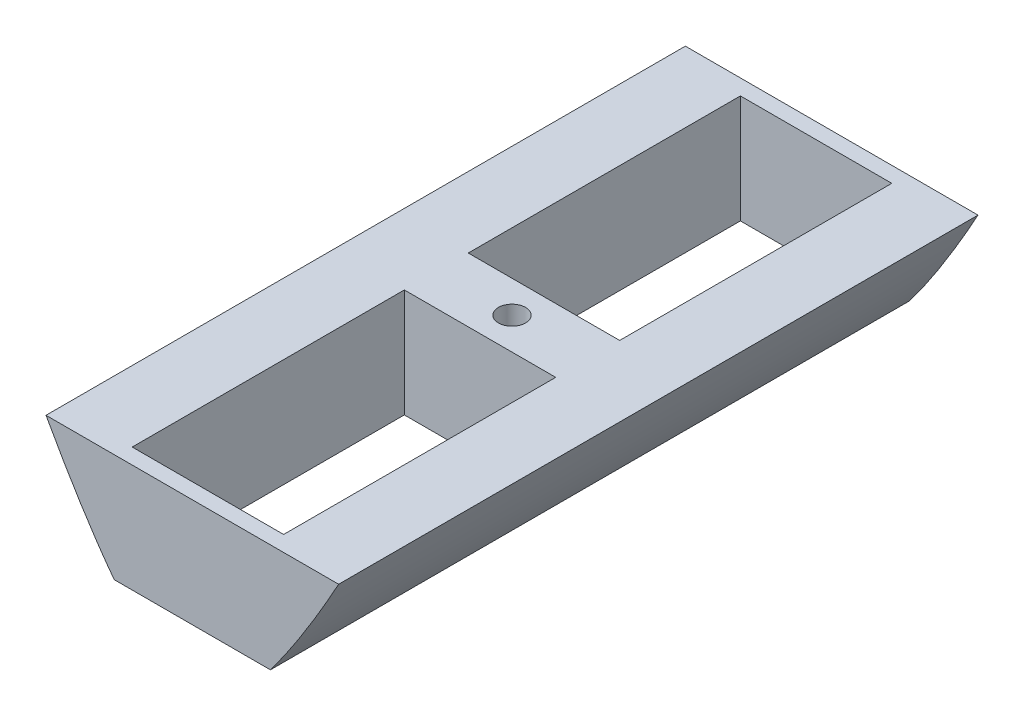
ISO-10303-21;
HEADER;
FILE_DESCRIPTION(('STEP AP214'),'2;1');
FILE_NAME('part.step','',(''),(''),'','','');
FILE_SCHEMA(('AUTOMOTIVE_DESIGN { 1 0 10303 214 1 1 1 1 }'));
ENDSEC;
DATA;
#1=APPLICATION_CONTEXT('core data for automotive mechanical design processes');
#2=APPLICATION_PROTOCOL_DEFINITION('international standard','automotive_design',2000,#1);
#3=PRODUCT_CONTEXT('',#1,'mechanical');
#4=PRODUCT('Part','Part','',(#3));
#5=PRODUCT_RELATED_PRODUCT_CATEGORY('part','',(#4));
#6=PRODUCT_DEFINITION_FORMATION('','',#4);
#7=PRODUCT_DEFINITION_CONTEXT('part definition',#1,'design');
#8=PRODUCT_DEFINITION('design','',#6,#7);
#9=PRODUCT_DEFINITION_SHAPE('','',#8);
#10=(LENGTH_UNIT() NAMED_UNIT(*) SI_UNIT(.MILLI.,.METRE.));
#11=(NAMED_UNIT(*) PLANE_ANGLE_UNIT() SI_UNIT($,.RADIAN.));
#12=(NAMED_UNIT(*) SI_UNIT($,.STERADIAN.) SOLID_ANGLE_UNIT());
#13=UNCERTAINTY_MEASURE_WITH_UNIT(LENGTH_MEASURE(1.E-05),#10,'distance_accuracy_value','');
#14=(GEOMETRIC_REPRESENTATION_CONTEXT(3) GLOBAL_UNCERTAINTY_ASSIGNED_CONTEXT((#13)) GLOBAL_UNIT_ASSIGNED_CONTEXT((#10,
#11,#12)) REPRESENTATION_CONTEXT('',''));
#15=CARTESIAN_POINT('',(0.,0.,0.));
#16=DIRECTION('',(0.,0.,1.));
#17=DIRECTION('',(1.,0.,0.));
#18=AXIS2_PLACEMENT_3D('',#15,#16,#17);
#19=CARTESIAN_POINT('',(0.,-92.52,0.));
#20=DIRECTION('',(0.,1.,0.));
#21=DIRECTION('',(0.,0.,1.));
#22=AXIS2_PLACEMENT_3D('',#19,#20,#21);
#23=PLANE('',#22);
#24=DIRECTION('',(1.,0.,0.));
#25=VECTOR('',#24,1.);
#26=CARTESIAN_POINT('',(-52.7426338619544,-92.52,-150.));
#27=LINE('',#26,#25);
#28=CARTESIAN_POINT('',(-36.6476947811617,-92.5200000005668,-150.));
#29=VERTEX_POINT('',#28);
#30=CARTESIAN_POINT('',(36.6477010865553,-92.5199999999962,-150.));
#31=VERTEX_POINT('',#30);
#32=EDGE_CURVE('E177',#29,#31,#27,.T.);
#33=ORIENTED_EDGE('',*,*,#32,.T.);
#34=DIRECTION('',(0.,0.,1.));
#35=VECTOR('',#34,1.);
#36=CARTESIAN_POINT('',(36.6477010865525,-92.52,-150.));
#37=LINE('',#36,#35);
#38=CARTESIAN_POINT('',(36.6477010865553,-92.5199999999962,150.));
#39=VERTEX_POINT('',#38);
#40=EDGE_CURVE('E133',#31,#39,#37,.T.);
#41=ORIENTED_EDGE('',*,*,#40,.T.);
#42=DIRECTION('',(1.,0.,0.));
#43=VECTOR('',#42,1.);
#44=CARTESIAN_POINT('',(-52.7426338619544,-92.52,150.));
#45=LINE('',#44,#43);
#46=CARTESIAN_POINT('',(-36.6476947811617,-92.5200000005668,150.));
#47=VERTEX_POINT('',#46);
#48=EDGE_CURVE('E137',#47,#39,#45,.T.);
#49=ORIENTED_EDGE('',*,*,#48,.F.);
#50=DIRECTION('',(0.,0.,1.));
#51=VECTOR('',#50,1.);
#52=CARTESIAN_POINT('',(-36.647694781587,-92.5200000000014,-150.));
#53=LINE('',#52,#51);
#54=EDGE_CURVE('E121',#47,#29,#53,.F.);
#55=ORIENTED_EDGE('',*,*,#54,.T.);
#56=EDGE_LOOP('',(#33,#41,#49,#55));
#57=FACE_BOUND('',#56,.T.);
#58=DIRECTION('',(0.,0.,1.));
#59=VECTOR('',#58,1.);
#60=CARTESIAN_POINT('',(-35.5200000000431,-92.5199999999835,-142.682));
#61=LINE('',#60,#59);
#62=CARTESIAN_POINT('',(-35.5200000000431,-92.5199999999835,-142.682));
#63=VERTEX_POINT('',#62);
#64=CARTESIAN_POINT('',(-35.5200000000431,-92.5199999999835,-15.));
#65=VERTEX_POINT('',#64);
#66=EDGE_CURVE('E289',#63,#65,#61,.T.);
#67=ORIENTED_EDGE('',*,*,#66,.T.);
#68=DIRECTION('',(1.,-4.6610767750375E-13,0.));
#69=VECTOR('',#68,1.);
#70=CARTESIAN_POINT('',(35.5199999999569,-92.5200000000166,-15.));
#71=LINE('',#70,#69);
#72=CARTESIAN_POINT('',(35.5199999999569,-92.5200000000166,-15.));
#73=VERTEX_POINT('',#72);
#74=EDGE_CURVE('E293',#65,#73,#71,.T.);
#75=ORIENTED_EDGE('',*,*,#74,.T.);
#76=DIRECTION('',(0.,0.,-1.));
#77=VECTOR('',#76,1.);
#78=CARTESIAN_POINT('',(35.5199999999569,-92.5200000000166,-142.682));
#79=LINE('',#78,#77);
#80=CARTESIAN_POINT('',(35.5199999999569,-92.5200000000166,-142.682));
#81=VERTEX_POINT('',#80);
#82=EDGE_CURVE('E296',#73,#81,#79,.T.);
#83=ORIENTED_EDGE('',*,*,#82,.T.);
#84=DIRECTION('',(-1.,4.6610767750375E-13,0.));
#85=VECTOR('',#84,1.);
#86=CARTESIAN_POINT('',(35.5199999999569,-92.5200000000166,-142.682));
#87=LINE('',#86,#85);
#88=EDGE_CURVE('E174',#81,#63,#87,.T.);
#89=ORIENTED_EDGE('',*,*,#88,.T.);
#90=EDGE_LOOP('',(#67,#75,#83,#89));
#91=FACE_BOUND('',#90,.T.);
#92=DIRECTION('',(0.,0.,-1.));
#93=VECTOR('',#92,1.);
#94=CARTESIAN_POINT('',(35.5199999999569,-92.5200000000166,142.682));
#95=LINE('',#94,#93);
#96=CARTESIAN_POINT('',(35.5199999999569,-92.5200000000166,142.682));
#97=VERTEX_POINT('',#96);
#98=CARTESIAN_POINT('',(35.5199999999569,-92.5200000000166,15.));
#99=VERTEX_POINT('',#98);
#100=EDGE_CURVE('E11',#97,#99,#95,.T.);
#101=ORIENTED_EDGE('',*,*,#100,.T.);
#102=DIRECTION('',(-1.,4.6610767750375E-13,0.));
#103=VECTOR('',#102,1.);
#104=CARTESIAN_POINT('',(35.5199999999569,-92.5200000000166,15.));
#105=LINE('',#104,#103);
#106=CARTESIAN_POINT('',(-35.5200000000431,-92.5199999999835,15.));
#107=VERTEX_POINT('',#106);
#108=EDGE_CURVE('E41',#99,#107,#105,.T.);
#109=ORIENTED_EDGE('',*,*,#108,.T.);
#110=DIRECTION('',(0.,0.,1.));
#111=VECTOR('',#110,1.);
#112=CARTESIAN_POINT('',(-35.5200000000431,-92.5199999999835,142.682));
#113=LINE('',#112,#111);
#114=CARTESIAN_POINT('',(-35.5200000000431,-92.5199999999835,142.682));
#115=VERTEX_POINT('',#114);
#116=EDGE_CURVE('E55',#107,#115,#113,.T.);
#117=ORIENTED_EDGE('',*,*,#116,.T.);
#118=DIRECTION('',(1.,-4.6610767750375E-13,0.));
#119=VECTOR('',#118,1.);
#120=CARTESIAN_POINT('',(35.5199999999569,-92.5200000000166,142.682));
#121=LINE('',#120,#119);
#122=EDGE_CURVE('E292',#115,#97,#121,.T.);
#123=ORIENTED_EDGE('',*,*,#122,.T.);
#124=EDGE_LOOP('',(#101,#109,#117,#123));
#125=FACE_BOUND('',#124,.T.);
#126=CARTESIAN_POINT('',(0.,-92.52,0.));
#127=DIRECTION('',(0.,1.,0.));
#128=DIRECTION('',(0.,0.,1.));
#129=AXIS2_PLACEMENT_3D('',#126,#127,#128);
#130=CIRCLE('',#129,6.35);
#131=CARTESIAN_POINT('',(0.,-92.52,6.35));
#132=VERTEX_POINT('',#131);
#133=EDGE_CURVE('E141',#132,#132,#130,.F.);
#134=ORIENTED_EDGE('',*,*,#133,.F.);
#135=EDGE_LOOP('',(#134));
#136=FACE_BOUND('',#135,.T.);
#137=ADVANCED_FACE('F33',(#57,#91,#125,#136),#23,.F.);
#138=CARTESIAN_POINT('',(0.,-41.72,0.));
#139=DIRECTION('',(0.,1.,0.));
#140=DIRECTION('',(0.,0.,1.));
#141=AXIS2_PLACEMENT_3D('',#138,#139,#140);
#142=PLANE('',#141);
#143=DIRECTION('',(-1.,0.,0.));
#144=VECTOR('',#143,1.);
#145=CARTESIAN_POINT('',(35.5199999999569,-41.72,-15.));
#146=LINE('',#145,#144);
#147=CARTESIAN_POINT('',(35.5199999999806,-41.72,-15.));
#148=VERTEX_POINT('',#147);
#149=CARTESIAN_POINT('',(-35.5200000000194,-41.72,-15.));
#150=VERTEX_POINT('',#149);
#151=EDGE_CURVE('E191',#148,#150,#146,.T.);
#152=ORIENTED_EDGE('',*,*,#151,.T.);
#153=DIRECTION('',(0.,0.,-1.));
#154=VECTOR('',#153,1.);
#155=CARTESIAN_POINT('',(-35.5200000000195,-41.72,-142.682));
#156=LINE('',#155,#154);
#157=CARTESIAN_POINT('',(-35.5200000000195,-41.72,-142.682));
#158=VERTEX_POINT('',#157);
#159=EDGE_CURVE('E200',#150,#158,#156,.T.);
#160=ORIENTED_EDGE('',*,*,#159,.T.);
#161=DIRECTION('',(1.,0.,0.));
#162=VECTOR('',#161,1.);
#163=CARTESIAN_POINT('',(35.5199999999569,-41.72,-142.682));
#164=LINE('',#163,#162);
#165=CARTESIAN_POINT('',(35.5199999999805,-41.72,-142.682));
#166=VERTEX_POINT('',#165);
#167=EDGE_CURVE('E197',#158,#166,#164,.T.);
#168=ORIENTED_EDGE('',*,*,#167,.T.);
#169=DIRECTION('',(0.,0.,1.));
#170=VECTOR('',#169,1.);
#171=CARTESIAN_POINT('',(35.5199999999805,-41.72,-142.682));
#172=LINE('',#171,#170);
#173=EDGE_CURVE('E194',#166,#148,#172,.T.);
#174=ORIENTED_EDGE('',*,*,#173,.T.);
#175=EDGE_LOOP('',(#152,#160,#168,#174));
#176=FACE_BOUND('',#175,.T.);
#177=DIRECTION('',(1.,0.,0.));
#178=VECTOR('',#177,1.);
#179=CARTESIAN_POINT('',(35.5199999999569,-41.72,15.));
#180=LINE('',#179,#178);
#181=CARTESIAN_POINT('',(-35.5200000000194,-41.72,15.));
#182=VERTEX_POINT('',#181);
#183=CARTESIAN_POINT('',(35.5199999999806,-41.72,15.));
#184=VERTEX_POINT('',#183);
#185=EDGE_CURVE('E175',#182,#184,#180,.T.);
#186=ORIENTED_EDGE('',*,*,#185,.T.);
#187=DIRECTION('',(0.,0.,1.));
#188=VECTOR('',#187,1.);
#189=CARTESIAN_POINT('',(35.5199999999805,-41.72,142.682));
#190=LINE('',#189,#188);
#191=CARTESIAN_POINT('',(35.5199999999805,-41.72,142.682));
#192=VERTEX_POINT('',#191);
#193=EDGE_CURVE('E188',#184,#192,#190,.T.);
#194=ORIENTED_EDGE('',*,*,#193,.T.);
#195=DIRECTION('',(-1.,0.,0.));
#196=VECTOR('',#195,1.);
#197=CARTESIAN_POINT('',(35.5199999999569,-41.72,142.682));
#198=LINE('',#197,#196);
#199=CARTESIAN_POINT('',(-35.5200000000195,-41.72,142.682));
#200=VERTEX_POINT('',#199);
#201=EDGE_CURVE('E185',#192,#200,#198,.T.);
#202=ORIENTED_EDGE('',*,*,#201,.T.);
#203=DIRECTION('',(0.,0.,-1.));
#204=VECTOR('',#203,1.);
#205=CARTESIAN_POINT('',(-35.5200000000195,-41.72,142.682));
#206=LINE('',#205,#204);
#207=EDGE_CURVE('E182',#200,#182,#206,.T.);
#208=ORIENTED_EDGE('',*,*,#207,.T.);
#209=EDGE_LOOP('',(#186,#194,#202,#208));
#210=FACE_BOUND('',#209,.T.);
#211=CARTESIAN_POINT('',(0.,-41.72,0.));
#212=DIRECTION('',(0.,1.,0.));
#213=DIRECTION('',(0.,0.,1.));
#214=AXIS2_PLACEMENT_3D('',#211,#212,#213);
#215=CIRCLE('',#214,6.35);
#216=CARTESIAN_POINT('',(0.,-41.72,6.35));
#217=VERTEX_POINT('',#216);
#218=EDGE_CURVE('E172',#217,#217,#215,.F.);
#219=ORIENTED_EDGE('',*,*,#218,.T.);
#220=EDGE_LOOP('',(#219));
#221=FACE_BOUND('',#220,.T.);
#222=DIRECTION('',(1.,0.,0.));
#223=VECTOR('',#222,1.);
#224=CARTESIAN_POINT('',(-52.7426338619544,-41.72,-150.));
#225=LINE('',#224,#223);
#226=CARTESIAN_POINT('',(-68.6535478647462,-41.7200000000003,-150.));
#227=VERTEX_POINT('',#226);
#228=CARTESIAN_POINT('',(68.6535448442305,-41.7199999999999,-150.));
#229=VERTEX_POINT('',#228);
#230=EDGE_CURVE('E36',#227,#229,#225,.T.);
#231=ORIENTED_EDGE('',*,*,#230,.F.);
#232=DIRECTION('',(0.,0.,1.));
#233=VECTOR('',#232,1.);
#234=CARTESIAN_POINT('',(-68.6535478647463,-41.72,-150.));
#235=LINE('',#234,#233);
#236=CARTESIAN_POINT('',(-68.6535478647462,-41.7200000000003,150.));
#237=VERTEX_POINT('',#236);
#238=EDGE_CURVE('E134',#237,#227,#235,.F.);
#239=ORIENTED_EDGE('',*,*,#238,.F.);
#240=DIRECTION('',(1.,0.,0.));
#241=VECTOR('',#240,1.);
#242=CARTESIAN_POINT('',(-52.7426338619544,-41.72,150.));
#243=LINE('',#242,#241);
#244=CARTESIAN_POINT('',(68.6535448442305,-41.7199999999999,150.));
#245=VERTEX_POINT('',#244);
#246=EDGE_CURVE('E146',#237,#245,#243,.T.);
#247=ORIENTED_EDGE('',*,*,#246,.T.);
#248=DIRECTION('',(0.,0.,1.));
#249=VECTOR('',#248,1.);
#250=CARTESIAN_POINT('',(68.6535448442304,-41.72,-150.));
#251=LINE('',#250,#249);
#252=EDGE_CURVE('E204',#229,#245,#251,.T.);
#253=ORIENTED_EDGE('',*,*,#252,.F.);
#254=EDGE_LOOP('',(#231,#239,#247,#253));
#255=FACE_BOUND('',#254,.T.);
#256=ADVANCED_FACE('F227',(#176,#210,#221,#255),#142,.T.);
#257=CARTESIAN_POINT('',(0.,-124.999999999991,0.));
#258=DIRECTION('',(0.,1.,0.));
#259=DIRECTION('',(0.,0.,1.));
#260=AXIS2_PLACEMENT_3D('',#257,#258,#259);
#261=CYLINDRICAL_SURFACE('',#260,6.35);
#262=ORIENTED_EDGE('',*,*,#133,.T.);
#263=EDGE_LOOP('',(#262));
#264=FACE_BOUND('',#263,.T.);
#265=ORIENTED_EDGE('',*,*,#218,.F.);
#266=EDGE_LOOP('',(#265));
#267=FACE_BOUND('',#266,.T.);
#268=ADVANCED_FACE('F229',(#264,#267),#261,.F.);
#269=CARTESIAN_POINT('',(35.5199999999569,-92.5200000000166,15.));
#270=DIRECTION('',(0.,0.,-1.));
#271=DIRECTION('',(-1.,0.,0.));
#272=AXIS2_PLACEMENT_3D('',#269,#270,#271);
#273=PLANE('',#272);
#274=ORIENTED_EDGE('',*,*,#185,.F.);
#275=DIRECTION('',(4.6610767750375E-13,1.,0.));
#276=VECTOR('',#275,1.);
#277=CARTESIAN_POINT('',(-35.5200000000431,-92.5199999999835,15.));
#278=LINE('',#277,#276);
#279=EDGE_CURVE('E282',#107,#182,#278,.T.);
#280=ORIENTED_EDGE('',*,*,#279,.F.);
#281=ORIENTED_EDGE('',*,*,#108,.F.);
#282=DIRECTION('',(4.6610767750375E-13,1.,0.));
#283=VECTOR('',#282,1.);
#284=CARTESIAN_POINT('',(35.5199999999569,-92.5200000000166,15.));
#285=LINE('',#284,#283);
#286=EDGE_CURVE('E283',#99,#184,#285,.T.);
#287=ORIENTED_EDGE('',*,*,#286,.T.);
#288=EDGE_LOOP('',(#274,#280,#281,#287));
#289=FACE_BOUND('',#288,.T.);
#290=ADVANCED_FACE('F235',(#289),#273,.F.);
#291=CARTESIAN_POINT('',(-35.5200000000431,-92.5199999999835,142.682));
#292=DIRECTION('',(-1.,4.6610767750375E-13,0.));
#293=DIRECTION('',(-4.6610767750375E-13,-1.,0.));
#294=AXIS2_PLACEMENT_3D('',#291,#292,#293);
#295=PLANE('',#294);
#296=ORIENTED_EDGE('',*,*,#207,.F.);
#297=DIRECTION('',(4.6610767750375E-13,1.,0.));
#298=VECTOR('',#297,1.);
#299=CARTESIAN_POINT('',(-35.5200000000431,-92.5199999999835,142.682));
#300=LINE('',#299,#298);
#301=EDGE_CURVE('E277',#115,#200,#300,.T.);
#302=ORIENTED_EDGE('',*,*,#301,.F.);
#303=ORIENTED_EDGE('',*,*,#116,.F.);
#304=ORIENTED_EDGE('',*,*,#279,.T.);
#305=EDGE_LOOP('',(#296,#302,#303,#304));
#306=FACE_BOUND('',#305,.T.);
#307=ADVANCED_FACE('F264',(#306),#295,.F.);
#308=CARTESIAN_POINT('',(35.5199999999569,-92.5200000000166,142.682));
#309=DIRECTION('',(1.,-4.6610767750375E-13,0.));
#310=DIRECTION('',(4.6610767750375E-13,1.,0.));
#311=AXIS2_PLACEMENT_3D('',#308,#309,#310);
#312=PLANE('',#311);
#313=ORIENTED_EDGE('',*,*,#193,.F.);
#314=ORIENTED_EDGE('',*,*,#286,.F.);
#315=ORIENTED_EDGE('',*,*,#100,.F.);
#316=DIRECTION('',(4.6610767750375E-13,1.,0.));
#317=VECTOR('',#316,1.);
#318=CARTESIAN_POINT('',(35.5199999999569,-92.5200000000166,142.682));
#319=LINE('',#318,#317);
#320=EDGE_CURVE('E276',#97,#192,#319,.T.);
#321=ORIENTED_EDGE('',*,*,#320,.T.);
#322=EDGE_LOOP('',(#313,#314,#315,#321));
#323=FACE_BOUND('',#322,.T.);
#324=ADVANCED_FACE('F261',(#323),#312,.F.);
#325=CARTESIAN_POINT('',(35.5199999999569,-92.5200000000166,142.682));
#326=DIRECTION('',(0.,0.,1.));
#327=DIRECTION('',(1.,0.,0.));
#328=AXIS2_PLACEMENT_3D('',#325,#326,#327);
#329=PLANE('',#328);
#330=ORIENTED_EDGE('',*,*,#201,.F.);
#331=ORIENTED_EDGE('',*,*,#320,.F.);
#332=ORIENTED_EDGE('',*,*,#122,.F.);
#333=ORIENTED_EDGE('',*,*,#301,.T.);
#334=EDGE_LOOP('',(#330,#331,#332,#333));
#335=FACE_BOUND('',#334,.T.);
#336=ADVANCED_FACE('F253',(#335),#329,.F.);
#337=CARTESIAN_POINT('',(35.5199999999569,-92.5200000000166,-15.));
#338=DIRECTION('',(0.,0.,1.));
#339=DIRECTION('',(1.,0.,0.));
#340=AXIS2_PLACEMENT_3D('',#337,#338,#339);
#341=PLANE('',#340);
#342=ORIENTED_EDGE('',*,*,#151,.F.);
#343=DIRECTION('',(4.6610767750375E-13,1.,0.));
#344=VECTOR('',#343,1.);
#345=CARTESIAN_POINT('',(35.5199999999569,-92.5200000000166,-15.));
#346=LINE('',#345,#344);
#347=EDGE_CURVE('E300',#73,#148,#346,.T.);
#348=ORIENTED_EDGE('',*,*,#347,.F.);
#349=ORIENTED_EDGE('',*,*,#74,.F.);
#350=DIRECTION('',(4.6610767750375E-13,1.,0.));
#351=VECTOR('',#350,1.);
#352=CARTESIAN_POINT('',(-35.5200000000431,-92.5199999999835,-15.));
#353=LINE('',#352,#351);
#354=EDGE_CURVE('E216',#65,#150,#353,.T.);
#355=ORIENTED_EDGE('',*,*,#354,.T.);
#356=EDGE_LOOP('',(#342,#348,#349,#355));
#357=FACE_BOUND('',#356,.T.);
#358=ADVANCED_FACE('F250',(#357),#341,.F.);
#359=CARTESIAN_POINT('',(35.5199999999569,-92.5200000000166,-142.682));
#360=DIRECTION('',(1.,-4.6610767750375E-13,0.));
#361=DIRECTION('',(4.6610767750375E-13,1.,0.));
#362=AXIS2_PLACEMENT_3D('',#359,#360,#361);
#363=PLANE('',#362);
#364=ORIENTED_EDGE('',*,*,#173,.F.);
#365=DIRECTION('',(4.6610767750375E-13,1.,0.));
#366=VECTOR('',#365,1.);
#367=CARTESIAN_POINT('',(35.5199999999569,-92.5200000000166,-142.682));
#368=LINE('',#367,#366);
#369=EDGE_CURVE('E151',#81,#166,#368,.T.);
#370=ORIENTED_EDGE('',*,*,#369,.F.);
#371=ORIENTED_EDGE('',*,*,#82,.F.);
#372=ORIENTED_EDGE('',*,*,#347,.T.);
#373=EDGE_LOOP('',(#364,#370,#371,#372));
#374=FACE_BOUND('',#373,.T.);
#375=ADVANCED_FACE('F248',(#374),#363,.F.);
#376=CARTESIAN_POINT('',(-35.5200000000431,-92.5199999999835,-142.682));
#377=DIRECTION('',(-1.,4.6610767750375E-13,0.));
#378=DIRECTION('',(-4.6610767750375E-13,-1.,0.));
#379=AXIS2_PLACEMENT_3D('',#376,#377,#378);
#380=PLANE('',#379);
#381=ORIENTED_EDGE('',*,*,#159,.F.);
#382=ORIENTED_EDGE('',*,*,#354,.F.);
#383=ORIENTED_EDGE('',*,*,#66,.F.);
#384=DIRECTION('',(4.6610767750375E-13,1.,0.));
#385=VECTOR('',#384,1.);
#386=CARTESIAN_POINT('',(-35.5200000000431,-92.5199999999835,-142.682));
#387=LINE('',#386,#385);
#388=EDGE_CURVE('E148',#63,#158,#387,.T.);
#389=ORIENTED_EDGE('',*,*,#388,.T.);
#390=EDGE_LOOP('',(#381,#382,#383,#389));
#391=FACE_BOUND('',#390,.T.);
#392=ADVANCED_FACE('F245',(#391),#380,.F.);
#393=CARTESIAN_POINT('',(35.5199999999569,-92.5200000000166,-142.682));
#394=DIRECTION('',(0.,0.,-1.));
#395=DIRECTION('',(-1.,0.,0.));
#396=AXIS2_PLACEMENT_3D('',#393,#394,#395);
#397=PLANE('',#396);
#398=ORIENTED_EDGE('',*,*,#167,.F.);
#399=ORIENTED_EDGE('',*,*,#388,.F.);
#400=ORIENTED_EDGE('',*,*,#88,.F.);
#401=ORIENTED_EDGE('',*,*,#369,.T.);
#402=EDGE_LOOP('',(#398,#399,#400,#401));
#403=FACE_BOUND('',#402,.T.);
#404=ADVANCED_FACE('F225',(#403),#397,.F.);
#405=CARTESIAN_POINT('',(-90.000000000001,2.02389109575604E-12,-150.));
#406=CARTESIAN_POINT('',(-89.7287799215119,-0.565041830183454,-150.));
#407=CARTESIAN_POINT('',(-89.1769696999906,-1.7119011396164,-150.));
#408=CARTESIAN_POINT('',(-88.1522968285625,-3.83418853962012,-150.));
#409=CARTESIAN_POINT('',(-87.0256216323926,-6.14778150957435,-150.));
#410=CARTESIAN_POINT('',(-85.7702408599494,-8.71205451363004,-150.));
#411=CARTESIAN_POINT('',(-84.5750109306655,-11.1331330972931,-150.));
#412=CARTESIAN_POINT('',(-83.3334861961047,-13.6323373136231,-150.));
#413=CARTESIAN_POINT('',(-82.1079807270131,-16.0793853852928,-150.));
#414=CARTESIAN_POINT('',(-80.8613078480234,-18.5512681634737,-150.));
#415=CARTESIAN_POINT('',(-79.6147241148221,-21.0031983730774,-150.));
#416=CARTESIAN_POINT('',(-78.0419469470306,-24.073051937383,-150.));
#417=CARTESIAN_POINT('',(-76.1411202296189,-27.7433014503863,-150.));
#418=CARTESIAN_POINT('',(-73.8976202164458,-32.0158335495403,-150.));
#419=CARTESIAN_POINT('',(-71.2993743897047,-36.8781590882088,-150.));
#420=CARTESIAN_POINT('',(-68.6634579703094,-41.7214329736065,-150.));
#421=CARTESIAN_POINT('',(-65.3196001268725,-47.7478310919678,-150.));
#422=CARTESIAN_POINT('',(-61.9057750936895,-53.7354515988975,-150.));
#423=CARTESIAN_POINT('',(-58.4153924458366,-59.6785805494722,-150.));
#424=CARTESIAN_POINT('',(-54.1245222469686,-66.7491790365763,-150.));
#425=CARTESIAN_POINT('',(-50.4569081107591,-72.584773085158,-150.));
#426=CARTESIAN_POINT('',(-46.6861989824506,-78.3546086656338,-150.));
#427=CARTESIAN_POINT('',(-42.0196546172396,-85.183243954868,-150.));
#428=CARTESIAN_POINT('',(-37.1971625918209,-91.9035094496485,-150.));
#429=CARTESIAN_POINT('',(-31.9659496817484,-98.6943750875519,-150.));
#430=CARTESIAN_POINT('',(-26.4240119309792,-105.235278479561,-150.));
#431=CARTESIAN_POINT('',(-21.5050773033514,-110.483804705851,-150.));
#432=CARTESIAN_POINT('',(-17.6257924713411,-114.241326427069,-150.));
#433=CARTESIAN_POINT('',(-14.1803245350885,-117.248508249794,-150.));
#434=CARTESIAN_POINT('',(-11.1234549797758,-119.618653213116,-150.));
#435=CARTESIAN_POINT('',(-8.63557314303448,-121.326761696326,-150.));
#436=CARTESIAN_POINT('',(-6.50865865296434,-122.601737804343,-150.));
#437=CARTESIAN_POINT('',(-4.76818473699802,-123.501182230943,-150.));
#438=CARTESIAN_POINT('',(-3.3618837973863,-124.11729408906,-150.));
#439=CARTESIAN_POINT('',(-2.23928333382458,-124.524207656603,-150.));
#440=CARTESIAN_POINT('',(-1.38198372297948,-124.772747972149,-150.));
#441=CARTESIAN_POINT('',(-0.75617299970219,-124.911034050922,-150.));
#442=CARTESIAN_POINT('',(-0.347330621147917,-124.973877643986,-150.));
#443=CARTESIAN_POINT('',(-0.123395647498381,-124.995337069226,-150.));
#444=CARTESIAN_POINT('',(-0.0205041113270957,-124.999999999991,-150.));
#445=CARTESIAN_POINT('',(1.99373958062784E-11,-124.999999999991,-150.));
#446=B_SPLINE_CURVE_WITH_KNOTS('',4,(#405,#406,#407,#408,#409,#410,#411,#412,#413,#414,#415,
#416,#417,#418,#419,#420,#421,#422,#423,#424,#425,#426,#427,#428,#429,#430,#431,#432,#433,#434,
#435,#436,#437,#438,#439,#440,#441,#442,#443,#444,#445),.UNSPECIFIED.,.F.,.F.,(5,1,1,1,1,1,1,1,
1,1,1,1,1,1,1,1,1,1,1,1,1,1,1,1,1,1,1,1,1,1,1,1,1,1,1,1,1,5),(0.0906040002037184,
0.106595296404402,0.122586592605086,0.138577888805769,0.154569185006453,0.170560469837402,
0.186551754668351,0.2025430394993,0.218534324330249,0.234525597989239,0.250516871648229,
0.282499418966208,0.314481991055738,0.346464563145268,0.378447154569264,0.410429745993261,
0.474394816871329,0.50637741432234,0.538360011773351,0.602325099359595,0.634307686149558,
0.666290272939521,0.730255400632888,0.794220554496453,0.833134058899479,0.865116624781684,
0.897099301206955,0.919478735971019,0.939186071609823,0.954818475650913,0.967077107134405,
0.976978528047083,0.984613115136046,0.990416571643528,0.994763933757022,0.997672430907831,
0.999476856470563,1.),.UNSPECIFIED.);
#447=DIRECTION('',(0.,0.,1.));
#448=VECTOR('',#447,1.);
#449=SURFACE_OF_LINEAR_EXTRUSION('',#446,#448);
#450=CARTESIAN_POINT('',(-90.000000000001,2.02389109575604E-12,150.));
#451=CARTESIAN_POINT('',(-89.7287799215119,-0.565041830183454,150.));
#452=CARTESIAN_POINT('',(-89.1769696999906,-1.7119011396164,150.));
#453=CARTESIAN_POINT('',(-88.1522968285625,-3.83418853962012,150.));
#454=CARTESIAN_POINT('',(-87.0256216323926,-6.14778150957435,150.));
#455=CARTESIAN_POINT('',(-85.7702408599494,-8.71205451363004,150.));
#456=CARTESIAN_POINT('',(-84.5750109306655,-11.1331330972931,150.));
#457=CARTESIAN_POINT('',(-83.3334861961047,-13.6323373136231,150.));
#458=CARTESIAN_POINT('',(-82.1079807270131,-16.0793853852928,150.));
#459=CARTESIAN_POINT('',(-80.8613078480234,-18.5512681634737,150.));
#460=CARTESIAN_POINT('',(-79.6147241148221,-21.0031983730774,150.));
#461=CARTESIAN_POINT('',(-78.0419469470306,-24.073051937383,150.));
#462=CARTESIAN_POINT('',(-76.1411202296189,-27.7433014503863,150.));
#463=CARTESIAN_POINT('',(-73.8976202164458,-32.0158335495403,150.));
#464=CARTESIAN_POINT('',(-71.2993743897047,-36.8781590882088,150.));
#465=CARTESIAN_POINT('',(-68.6634579703094,-41.7214329736065,150.));
#466=CARTESIAN_POINT('',(-65.3196001268725,-47.7478310919678,150.));
#467=CARTESIAN_POINT('',(-61.9057750936895,-53.7354515988975,150.));
#468=CARTESIAN_POINT('',(-58.4153924458366,-59.6785805494722,150.));
#469=CARTESIAN_POINT('',(-54.1245222469686,-66.7491790365763,150.));
#470=CARTESIAN_POINT('',(-50.4569081107591,-72.584773085158,150.));
#471=CARTESIAN_POINT('',(-46.6861989824506,-78.3546086656338,150.));
#472=CARTESIAN_POINT('',(-42.0196546172396,-85.183243954868,150.));
#473=CARTESIAN_POINT('',(-37.1971625918209,-91.9035094496485,150.));
#474=CARTESIAN_POINT('',(-31.9659496817484,-98.6943750875519,150.));
#475=CARTESIAN_POINT('',(-26.4240119309792,-105.235278479561,150.));
#476=CARTESIAN_POINT('',(-21.5050773033514,-110.483804705851,150.));
#477=CARTESIAN_POINT('',(-17.6257924713411,-114.241326427069,150.));
#478=CARTESIAN_POINT('',(-14.1803245350885,-117.248508249794,150.));
#479=CARTESIAN_POINT('',(-11.1234549797758,-119.618653213116,150.));
#480=CARTESIAN_POINT('',(-8.63557314303448,-121.326761696326,150.));
#481=CARTESIAN_POINT('',(-6.50865865296434,-122.601737804343,150.));
#482=CARTESIAN_POINT('',(-4.76818473699802,-123.501182230943,150.));
#483=CARTESIAN_POINT('',(-3.3618837973863,-124.11729408906,150.));
#484=CARTESIAN_POINT('',(-2.23928333382458,-124.524207656603,150.));
#485=CARTESIAN_POINT('',(-1.38198372297948,-124.772747972149,150.));
#486=CARTESIAN_POINT('',(-0.75617299970219,-124.911034050922,150.));
#487=CARTESIAN_POINT('',(-0.347330621147917,-124.973877643986,150.));
#488=CARTESIAN_POINT('',(-0.123395647498381,-124.995337069226,150.));
#489=CARTESIAN_POINT('',(-0.0205041113270957,-124.999999999991,150.));
#490=CARTESIAN_POINT('',(1.99373958062784E-11,-124.999999999991,150.));
#491=B_SPLINE_CURVE_WITH_KNOTS('',4,(#450,#451,#452,#453,#454,#455,#456,#457,#458,#459,#460,
#461,#462,#463,#464,#465,#466,#467,#468,#469,#470,#471,#472,#473,#474,#475,#476,#477,#478,#479,
#480,#481,#482,#483,#484,#485,#486,#487,#488,#489,#490),.UNSPECIFIED.,.F.,.F.,(5,1,1,1,1,1,1,1,
1,1,1,1,1,1,1,1,1,1,1,1,1,1,1,1,1,1,1,1,1,1,1,1,1,1,1,1,1,5),(0.0906040002037184,
0.106595296404402,0.122586592605086,0.138577888805769,0.154569185006453,0.170560469837402,
0.186551754668351,0.2025430394993,0.218534324330249,0.234525597989239,0.250516871648229,
0.282499418966208,0.314481991055738,0.346464563145268,0.378447154569264,0.410429745993261,
0.474394816871329,0.50637741432234,0.538360011773351,0.602325099359595,0.634307686149558,
0.666290272939521,0.730255400632888,0.794220554496453,0.833134058899479,0.865116624781684,
0.897099301206955,0.919478735971019,0.939186071609823,0.954818475650913,0.967077107134405,
0.976978528047083,0.984613115136046,0.990416571643528,0.994763933757022,0.997672430907831,
0.999476856470563,1.),.UNSPECIFIED.);
#492=EDGE_CURVE('E126',#237,#47,#491,.T.);
#493=ORIENTED_EDGE('',*,*,#492,.F.);
#494=ORIENTED_EDGE('',*,*,#238,.T.);
#495=EDGE_CURVE('E129',#227,#29,#446,.T.);
#496=ORIENTED_EDGE('',*,*,#495,.T.);
#497=ORIENTED_EDGE('',*,*,#54,.F.);
#498=EDGE_LOOP('',(#493,#494,#496,#497));
#499=FACE_BOUND('',#498,.T.);
#500=ADVANCED_FACE('F123',(#499),#449,.T.);
#501=CARTESIAN_POINT('',(1.99214129898486E-11,-124.999999999991,-150.));
#502=CARTESIAN_POINT('',(0.04052417634533,-124.999999999991,-150.));
#503=CARTESIAN_POINT('',(0.132680738283907,-124.99443985728,-150.));
#504=CARTESIAN_POINT('',(0.341916523726012,-124.973583458145,-150.));
#505=CARTESIAN_POINT('',(0.719215848390711,-124.91674855859,-150.));
#506=CARTESIAN_POINT('',(1.28935930871222,-124.795671244914,-150.));
#507=CARTESIAN_POINT('',(2.1112509865546,-124.564993975685,-150.));
#508=CARTESIAN_POINT('',(3.18818849420226,-124.185399035379,-150.));
#509=CARTESIAN_POINT('',(4.55335692038526,-123.602067095226,-150.));
#510=CARTESIAN_POINT('',(6.24002426541317,-122.749483932227,-150.));
#511=CARTESIAN_POINT('',(8.30348536666619,-121.537471111829,-150.));
#512=CARTESIAN_POINT('',(10.7243382527977,-119.906336413897,-150.));
#513=CARTESIAN_POINT('',(13.7092244855474,-117.633146505461,-150.));
#514=CARTESIAN_POINT('',(17.1252704538273,-114.699994739705,-150.));
#515=CARTESIAN_POINT('',(20.824901988488,-111.164506708708,-150.));
#516=CARTESIAN_POINT('',(25.6391672478892,-106.109725012407,-150.));
#517=CARTESIAN_POINT('',(30.2221890811447,-100.781084361829,-150.));
#518=CARTESIAN_POINT('',(34.5982081132701,-95.2835059363638,-150.));
#519=CARTESIAN_POINT('',(38.7796921951659,-89.6846419299041,-150.));
#520=CARTESIAN_POINT('',(42.0337209653883,-85.1391537234017,-150.));
#521=CARTESIAN_POINT('',(45.9985706416375,-79.3851400766188,-150.));
#522=CARTESIAN_POINT('',(50.6076658418213,-72.3798694722059,-150.));
#523=CARTESIAN_POINT('',(55.055097052488,-65.270591125802,-150.));
#524=CARTESIAN_POINT('',(59.3647173178988,-58.0777276161543,-150.));
#525=CARTESIAN_POINT('',(62.8735066015738,-52.0349417086849,-150.));
#526=CARTESIAN_POINT('',(65.634088968463,-47.1744500309476,-150.));
#527=CARTESIAN_POINT('',(68.3515562987782,-42.2889644712454,-150.));
#528=CARTESIAN_POINT('',(71.0277192556287,-37.3820919874342,-150.));
#529=CARTESIAN_POINT('',(73.6663047604021,-32.452622561229,-150.));
#530=CARTESIAN_POINT('',(76.2670434158788,-27.5070381241099,-150.));
#531=CARTESIAN_POINT('',(78.5150328576176,-23.1588395824158,-150.));
#532=CARTESIAN_POINT('',(80.4175372929979,-19.4295342924188,-150.));
#533=CARTESIAN_POINT('',(81.9960888607339,-16.3021347604907,-150.));
#534=CARTESIAN_POINT('',(83.240093312196,-13.8196133785879,-150.));
#535=CARTESIAN_POINT('',(84.4992613941908,-11.2861580881193,-150.));
#536=CARTESIAN_POINT('',(85.7104943097678,-8.83370724481799,-150.));
#537=CARTESIAN_POINT('',(86.9855106959538,-6.22997447285261,-150.));
#538=CARTESIAN_POINT('',(88.1249163210447,-3.89080690589355,-150.));
#539=CARTESIAN_POINT('',(89.1658132896917,-1.73506722129004,-150.));
#540=CARTESIAN_POINT('',(89.7250298990975,-0.57285437685675,-150.));
#541=CARTESIAN_POINT('',(89.9999999999832,-1.11765701056352E-11,-150.));
#542=B_SPLINE_CURVE_WITH_KNOTS('',4,(#501,#502,#503,#504,#505,#506,#507,#508,#509,#510,#511,
#512,#513,#514,#515,#516,#517,#518,#519,#520,#521,#522,#523,#524,#525,#526,#527,#528,#529,#530,
#531,#532,#533,#534,#535,#536,#537,#538,#539,#540,#541),.UNSPECIFIED.,.F.,.F.,(5,1,1,1,1,1,1,1,
1,1,1,1,1,1,1,1,1,1,1,1,1,1,1,1,1,1,1,1,1,1,1,1,1,1,1,1,1,5),(0.,0.00103393706164033,
0.00206787412328066,0.00483210811938311,0.00888853236437909,0.0145219388316572,
0.0218771335459272,0.0312978599904631,0.0433163034992764,0.0583393941879713,0.0773686452817039,
0.0989852332180189,0.130325067263289,0.162749733599858,0.196051036585961,0.260900538334195,
0.293325323762978,0.325750109191762,0.358174889345657,0.390599669499551,0.455449159051982,
0.520298707054147,0.552723498859379,0.585148290664611,0.617573035285626,0.649997779906641,
0.682422553117547,0.714847326328452,0.747272094857862,0.779696863387272,0.795909247738012,
0.812121632088752,0.828334016439492,0.844546400790232,0.860758800534671,0.876971200279109,
0.893183600023547,0.909395999767985),.UNSPECIFIED.);
#543=DIRECTION('',(0.,0.,1.));
#544=VECTOR('',#543,1.);
#545=SURFACE_OF_LINEAR_EXTRUSION('',#542,#544);
#546=EDGE_CURVE('E156',#31,#229,#542,.T.);
#547=ORIENTED_EDGE('',*,*,#546,.T.);
#548=ORIENTED_EDGE('',*,*,#252,.T.);
#549=CARTESIAN_POINT('',(1.99214129898486E-11,-124.999999999991,150.));
#550=CARTESIAN_POINT('',(0.04052417634533,-124.999999999991,150.));
#551=CARTESIAN_POINT('',(0.132680738283907,-124.99443985728,150.));
#552=CARTESIAN_POINT('',(0.341916523726012,-124.973583458145,150.));
#553=CARTESIAN_POINT('',(0.719215848390711,-124.91674855859,150.));
#554=CARTESIAN_POINT('',(1.28935930871222,-124.795671244914,150.));
#555=CARTESIAN_POINT('',(2.1112509865546,-124.564993975685,150.));
#556=CARTESIAN_POINT('',(3.18818849420226,-124.185399035379,150.));
#557=CARTESIAN_POINT('',(4.55335692038526,-123.602067095226,150.));
#558=CARTESIAN_POINT('',(6.24002426541317,-122.749483932227,150.));
#559=CARTESIAN_POINT('',(8.30348536666619,-121.537471111829,150.));
#560=CARTESIAN_POINT('',(10.7243382527977,-119.906336413897,150.));
#561=CARTESIAN_POINT('',(13.7092244855474,-117.633146505461,150.));
#562=CARTESIAN_POINT('',(17.1252704538273,-114.699994739705,150.));
#563=CARTESIAN_POINT('',(20.824901988488,-111.164506708708,150.));
#564=CARTESIAN_POINT('',(25.6391672478892,-106.109725012407,150.));
#565=CARTESIAN_POINT('',(30.2221890811447,-100.781084361829,150.));
#566=CARTESIAN_POINT('',(34.5982081132701,-95.2835059363638,150.));
#567=CARTESIAN_POINT('',(38.7796921951659,-89.6846419299041,150.));
#568=CARTESIAN_POINT('',(42.0337209653883,-85.1391537234017,150.));
#569=CARTESIAN_POINT('',(45.9985706416375,-79.3851400766188,150.));
#570=CARTESIAN_POINT('',(50.6076658418213,-72.3798694722059,150.));
#571=CARTESIAN_POINT('',(55.055097052488,-65.270591125802,150.));
#572=CARTESIAN_POINT('',(59.3647173178988,-58.0777276161543,150.));
#573=CARTESIAN_POINT('',(62.8735066015738,-52.0349417086849,150.));
#574=CARTESIAN_POINT('',(65.634088968463,-47.1744500309476,150.));
#575=CARTESIAN_POINT('',(68.3515562987782,-42.2889644712454,150.));
#576=CARTESIAN_POINT('',(71.0277192556287,-37.3820919874342,150.));
#577=CARTESIAN_POINT('',(73.6663047604021,-32.452622561229,150.));
#578=CARTESIAN_POINT('',(76.2670434158788,-27.5070381241099,150.));
#579=CARTESIAN_POINT('',(78.5150328576176,-23.1588395824158,150.));
#580=CARTESIAN_POINT('',(80.4175372929979,-19.4295342924188,150.));
#581=CARTESIAN_POINT('',(81.9960888607339,-16.3021347604907,150.));
#582=CARTESIAN_POINT('',(83.240093312196,-13.8196133785879,150.));
#583=CARTESIAN_POINT('',(84.4992613941908,-11.2861580881193,150.));
#584=CARTESIAN_POINT('',(85.7104943097678,-8.83370724481799,150.));
#585=CARTESIAN_POINT('',(86.9855106959538,-6.22997447285261,150.));
#586=CARTESIAN_POINT('',(88.1249163210447,-3.89080690589355,150.));
#587=CARTESIAN_POINT('',(89.1658132896917,-1.73506722129004,150.));
#588=CARTESIAN_POINT('',(89.7250298990975,-0.57285437685675,150.));
#589=CARTESIAN_POINT('',(89.9999999999832,-1.11765701056352E-11,150.));
#590=B_SPLINE_CURVE_WITH_KNOTS('',4,(#549,#550,#551,#552,#553,#554,#555,#556,#557,#558,#559,
#560,#561,#562,#563,#564,#565,#566,#567,#568,#569,#570,#571,#572,#573,#574,#575,#576,#577,#578,
#579,#580,#581,#582,#583,#584,#585,#586,#587,#588,#589),.UNSPECIFIED.,.F.,.F.,(5,1,1,1,1,1,1,1,
1,1,1,1,1,1,1,1,1,1,1,1,1,1,1,1,1,1,1,1,1,1,1,1,1,1,1,1,1,5),(0.,0.00103393706164033,
0.00206787412328066,0.00483210811938311,0.00888853236437909,0.0145219388316572,
0.0218771335459272,0.0312978599904631,0.0433163034992764,0.0583393941879713,0.0773686452817039,
0.0989852332180189,0.130325067263289,0.162749733599858,0.196051036585961,0.260900538334195,
0.293325323762978,0.325750109191762,0.358174889345657,0.390599669499551,0.455449159051982,
0.520298707054147,0.552723498859379,0.585148290664611,0.617573035285626,0.649997779906641,
0.682422553117547,0.714847326328452,0.747272094857862,0.779696863387272,0.795909247738012,
0.812121632088752,0.828334016439492,0.844546400790232,0.860758800534671,0.876971200279109,
0.893183600023547,0.909395999767985),.UNSPECIFIED.);
#591=EDGE_CURVE('E147',#39,#245,#590,.T.);
#592=ORIENTED_EDGE('',*,*,#591,.F.);
#593=ORIENTED_EDGE('',*,*,#40,.F.);
#594=EDGE_LOOP('',(#547,#548,#592,#593));
#595=FACE_BOUND('',#594,.T.);
#596=ADVANCED_FACE('F224',(#595),#545,.T.);
#597=CARTESIAN_POINT('',(-52.7426338619544,-68.9224547357826,-150.));
#598=DIRECTION('',(0.,0.,-1.));
#599=DIRECTION('',(-1.,0.,0.));
#600=AXIS2_PLACEMENT_3D('',#597,#598,#599);
#601=PLANE('',#600);
#602=ORIENTED_EDGE('',*,*,#495,.F.);
#603=ORIENTED_EDGE('',*,*,#230,.T.);
#604=ORIENTED_EDGE('',*,*,#546,.F.);
#605=ORIENTED_EDGE('',*,*,#32,.F.);
#606=EDGE_LOOP('',(#602,#603,#604,#605));
#607=FACE_BOUND('',#606,.T.);
#608=ADVANCED_FACE('F208',(#607),#601,.T.);
#609=CARTESIAN_POINT('',(-52.7426338619544,-68.9224547357826,150.));
#610=DIRECTION('',(0.,0.,-1.));
#611=DIRECTION('',(-1.,0.,0.));
#612=AXIS2_PLACEMENT_3D('',#609,#610,#611);
#613=PLANE('',#612);
#614=ORIENTED_EDGE('',*,*,#246,.F.);
#615=ORIENTED_EDGE('',*,*,#492,.T.);
#616=ORIENTED_EDGE('',*,*,#48,.T.);
#617=ORIENTED_EDGE('',*,*,#591,.T.);
#618=EDGE_LOOP('',(#614,#615,#616,#617));
#619=FACE_BOUND('',#618,.T.);
#620=ADVANCED_FACE('F144',(#619),#613,.F.);
#621=CLOSED_SHELL('',(#137,#256,#268,#290,#307,#324,#336,#358,#375,#392,#404,#500,#596,#608,#620));
#622=MANIFOLD_SOLID_BREP('B2',#621);
#623=ADVANCED_BREP_SHAPE_REPRESENTATION('',(#18,#622),#14);
#624=SHAPE_DEFINITION_REPRESENTATION(#9,#623);
ENDSEC;
END-ISO-10303-21;
